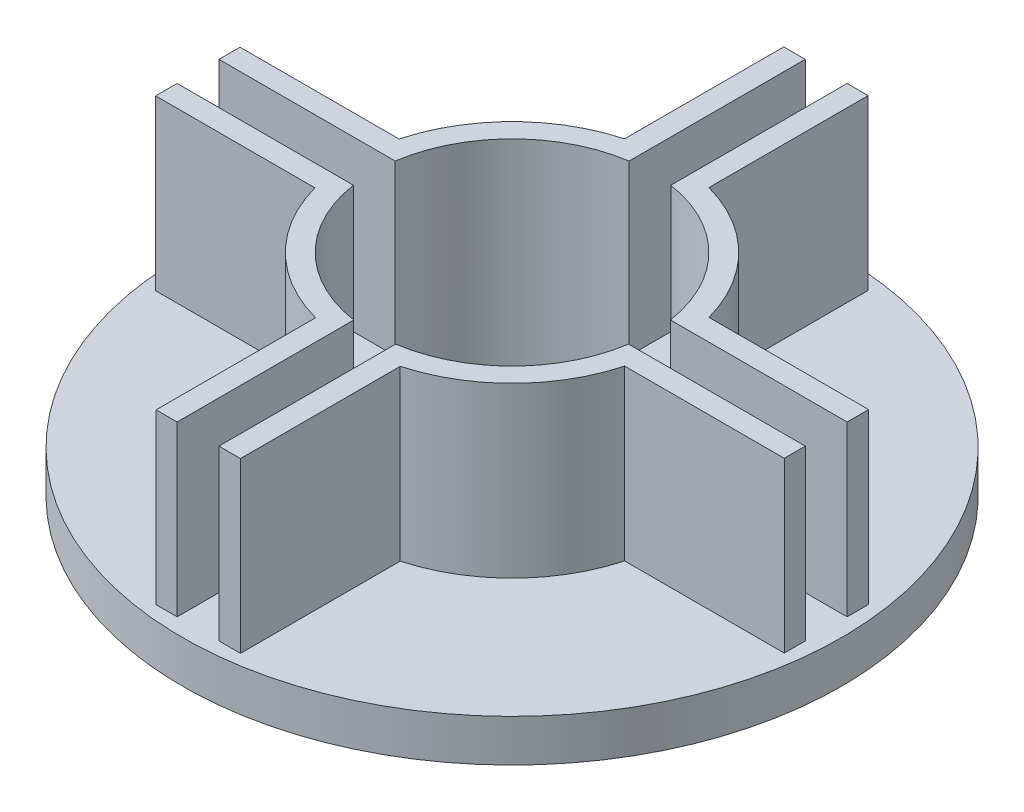
ISO-10303-21;
HEADER;
FILE_DESCRIPTION(('STEP AP214'),'2;1');
FILE_NAME('part.step','',(''),(''),'','','');
FILE_SCHEMA(('AUTOMOTIVE_DESIGN { 1 0 10303 214 1 1 1 1 }'));
ENDSEC;
DATA;
#1=APPLICATION_CONTEXT('core data for automotive mechanical design processes');
#2=APPLICATION_PROTOCOL_DEFINITION('international standard','automotive_design',2000,#1);
#3=PRODUCT_CONTEXT('',#1,'mechanical');
#4=PRODUCT('Part','Part','',(#3));
#5=PRODUCT_RELATED_PRODUCT_CATEGORY('part','',(#4));
#6=PRODUCT_DEFINITION_FORMATION('','',#4);
#7=PRODUCT_DEFINITION_CONTEXT('part definition',#1,'design');
#8=PRODUCT_DEFINITION('design','',#6,#7);
#9=PRODUCT_DEFINITION_SHAPE('','',#8);
#10=(LENGTH_UNIT() NAMED_UNIT(*) SI_UNIT(.MILLI.,.METRE.));
#11=(NAMED_UNIT(*) PLANE_ANGLE_UNIT() SI_UNIT($,.RADIAN.));
#12=(NAMED_UNIT(*) SI_UNIT($,.STERADIAN.) SOLID_ANGLE_UNIT());
#13=UNCERTAINTY_MEASURE_WITH_UNIT(LENGTH_MEASURE(1.E-05),#10,'distance_accuracy_value','');
#14=(GEOMETRIC_REPRESENTATION_CONTEXT(3) GLOBAL_UNCERTAINTY_ASSIGNED_CONTEXT((#13)) GLOBAL_UNIT_ASSIGNED_CONTEXT((#10,
#11,#12)) REPRESENTATION_CONTEXT('',''));
#15=CARTESIAN_POINT('',(0.,0.,0.));
#16=DIRECTION('',(0.,0.,1.));
#17=DIRECTION('',(1.,0.,0.));
#18=AXIS2_PLACEMENT_3D('',#15,#16,#17);
#19=CARTESIAN_POINT('',(0.,25.4,0.));
#20=DIRECTION('',(0.,1.,0.));
#21=DIRECTION('',(0.,0.,1.));
#22=AXIS2_PLACEMENT_3D('',#19,#20,#21);
#23=PLANE('',#22);
#24=DIRECTION('',(0.,0.,-1.));
#25=VECTOR('',#24,1.);
#26=CARTESIAN_POINT('',(3.1844151598015,25.4,-47.2495068220518));
#27=LINE('',#26,#25);
#28=CARTESIAN_POINT('',(3.1844151598015,25.4,-20.711627774997));
#29=VERTEX_POINT('',#28);
#30=CARTESIAN_POINT('',(3.1844151598015,25.4,-47.2495068220518));
#31=VERTEX_POINT('',#30);
#32=EDGE_CURVE('E243',#29,#31,#27,.T.);
#33=ORIENTED_EDGE('',*,*,#32,.F.);
#34=CARTESIAN_POINT('',(0.,25.4,0.));
#35=DIRECTION('',(0.,1.,0.));
#36=DIRECTION('',(0.,0.,1.));
#37=AXIS2_PLACEMENT_3D('',#34,#35,#36);
#38=CIRCLE('',#37,20.955);
#39=CARTESIAN_POINT('',(20.721291310276,25.4,-3.12091515980172));
#40=VERTEX_POINT('',#39);
#41=EDGE_CURVE('E360',#29,#40,#38,.F.);
#42=ORIENTED_EDGE('',*,*,#41,.T.);
#43=DIRECTION('',(1.,0.,0.));
#44=VECTOR('',#43,1.);
#45=CARTESIAN_POINT('',(47.3130068220515,25.4,-3.12091515980172));
#46=LINE('',#45,#44);
#47=CARTESIAN_POINT('',(47.3130068220515,25.4,-3.12091515980172));
#48=VERTEX_POINT('',#47);
#49=EDGE_CURVE('E452',#40,#48,#46,.T.);
#50=ORIENTED_EDGE('',*,*,#49,.T.);
#51=DIRECTION('',(0.,0.,-1.));
#52=VECTOR('',#51,1.);
#53=CARTESIAN_POINT('',(47.3130068220515,25.4,-6.35941515980172));
#54=LINE('',#53,#52);
#55=CARTESIAN_POINT('',(47.3130068220515,25.4,-6.35941515980172));
#56=VERTEX_POINT('',#55);
#57=EDGE_CURVE('E448',#48,#56,#54,.T.);
#58=ORIENTED_EDGE('',*,*,#57,.T.);
#59=DIRECTION('',(-1.,0.,0.));
#60=VECTOR('',#59,1.);
#61=CARTESIAN_POINT('',(22.1913230217083,25.4,-6.35941515980172));
#62=LINE('',#61,#60);
#63=CARTESIAN_POINT('',(23.2769142891682,25.4,-6.35941515980172));
#64=VERTEX_POINT('',#63);
#65=EDGE_CURVE('E441',#56,#64,#62,.T.);
#66=ORIENTED_EDGE('',*,*,#65,.T.);
#67=CARTESIAN_POINT('',(0.,25.4,0.));
#68=DIRECTION('',(0.,1.,0.));
#69=DIRECTION('',(0.,0.,1.));
#70=AXIS2_PLACEMENT_3D('',#67,#68,#69);
#71=CIRCLE('',#70,24.13);
#72=CARTESIAN_POINT('',(6.35,25.4,-23.2794845303757));
#73=VERTEX_POINT('',#72);
#74=EDGE_CURVE('E296',#64,#73,#71,.T.);
#75=ORIENTED_EDGE('',*,*,#74,.T.);
#76=DIRECTION('',(0.,0.,-1.));
#77=VECTOR('',#76,1.);
#78=CARTESIAN_POINT('',(6.35,25.4,-22.1278230217086));
#79=LINE('',#78,#77);
#80=CARTESIAN_POINT('',(6.35,25.4,-47.2495068220518));
#81=VERTEX_POINT('',#80);
#82=EDGE_CURVE('E267',#73,#81,#79,.T.);
#83=ORIENTED_EDGE('',*,*,#82,.T.);
#84=DIRECTION('',(-1.,0.,0.));
#85=VECTOR('',#84,1.);
#86=CARTESIAN_POINT('',(6.35,25.4,-47.2495068220518));
#87=LINE('',#86,#85);
#88=EDGE_CURVE('E261',#81,#31,#87,.T.);
#89=ORIENTED_EDGE('',*,*,#88,.T.);
#90=EDGE_LOOP('',(#33,#42,#50,#58,#66,#75,#83,#89));
#91=FACE_BOUND('',#90,.T.);
#92=ADVANCED_FACE('F37',(#91),#23,.T.);
#93=CARTESIAN_POINT('',(20.7130731664811,25.4,3.17499999999979));
#94=VERTEX_POINT('',#93);
#95=CARTESIAN_POINT('',(3.1844151598015,25.4,20.711627774997));
#96=VERTEX_POINT('',#95);
#97=EDGE_CURVE('E357',#94,#96,#38,.F.);
#98=ORIENTED_EDGE('',*,*,#97,.T.);
#99=DIRECTION('',(0.,0.,1.));
#100=VECTOR('',#99,1.);
#101=CARTESIAN_POINT('',(3.1844151598015,25.4,47.3035916622498));
#102=LINE('',#101,#100);
#103=CARTESIAN_POINT('',(3.1844151598015,25.4,47.3035916622498));
#104=VERTEX_POINT('',#103);
#105=EDGE_CURVE('E413',#96,#104,#102,.T.);
#106=ORIENTED_EDGE('',*,*,#105,.T.);
#107=DIRECTION('',(1.,0.,0.));
#108=VECTOR('',#107,1.);
#109=CARTESIAN_POINT('',(6.4229151598015,25.4,47.3035916622498));
#110=LINE('',#109,#108);
#111=CARTESIAN_POINT('',(6.4229151598015,25.4,47.3035916622498));
#112=VERTEX_POINT('',#111);
#113=EDGE_CURVE('E409',#104,#112,#110,.T.);
#114=ORIENTED_EDGE('',*,*,#113,.T.);
#115=DIRECTION('',(0.,0.,-1.));
#116=VECTOR('',#115,1.);
#117=CARTESIAN_POINT('',(6.4229151598015,25.4,22.1819078619066));
#118=LINE('',#117,#116);
#119=CARTESIAN_POINT('',(6.4229151598015,25.4,23.2594724972428));
#120=VERTEX_POINT('',#119);
#121=EDGE_CURVE('E402',#112,#120,#118,.T.);
#122=ORIENTED_EDGE('',*,*,#121,.T.);
#123=CARTESIAN_POINT('',(0.,25.4,0.));
#124=DIRECTION('',(0.,1.,0.));
#125=DIRECTION('',(0.,0.,1.));
#126=AXIS2_PLACEMENT_3D('',#123,#124,#125);
#127=CIRCLE('',#126,24.13);
#128=CARTESIAN_POINT('',(23.28205068039,25.4,6.34058484019828));
#129=VERTEX_POINT('',#128);
#130=EDGE_CURVE('E294',#120,#129,#127,.T.);
#131=ORIENTED_EDGE('',*,*,#130,.T.);
#132=DIRECTION('',(1.,0.,0.));
#133=VECTOR('',#132,1.);
#134=CARTESIAN_POINT('',(22.1913230217083,25.4,6.34058484019828));
#135=LINE('',#134,#133);
#136=CARTESIAN_POINT('',(47.3130068220515,25.4,6.34058484019828));
#137=VERTEX_POINT('',#136);
#138=EDGE_CURVE('E464',#129,#137,#135,.T.);
#139=ORIENTED_EDGE('',*,*,#138,.T.);
#140=DIRECTION('',(0.,0.,-1.));
#141=VECTOR('',#140,1.);
#142=CARTESIAN_POINT('',(47.3130068220515,25.4,6.34058484019828));
#143=LINE('',#142,#141);
#144=CARTESIAN_POINT('',(47.3130068220515,25.4,3.17499999999979));
#145=VERTEX_POINT('',#144);
#146=EDGE_CURVE('E468',#137,#145,#143,.T.);
#147=ORIENTED_EDGE('',*,*,#146,.T.);
#148=DIRECTION('',(1.,0.,0.));
#149=VECTOR('',#148,1.);
#150=CARTESIAN_POINT('',(47.3130068220515,25.4,3.17499999999979));
#151=LINE('',#150,#149);
#152=EDGE_CURVE('E338',#94,#145,#151,.T.);
#153=ORIENTED_EDGE('',*,*,#152,.F.);
#154=EDGE_LOOP('',(#98,#106,#114,#122,#131,#139,#147,#153));
#155=FACE_BOUND('',#154,.T.);
#156=ADVANCED_FACE('F602',(#155),#23,.T.);
#157=CARTESIAN_POINT('',(-20.721291310276,25.4,-3.12091515980172));
#158=VERTEX_POINT('',#157);
#159=CARTESIAN_POINT('',(-3.1115,25.4,-20.7227071771523));
#160=VERTEX_POINT('',#159);
#161=EDGE_CURVE('E361',#158,#160,#38,.F.);
#162=ORIENTED_EDGE('',*,*,#161,.T.);
#163=DIRECTION('',(0.,0.,1.));
#164=VECTOR('',#163,1.);
#165=CARTESIAN_POINT('',(-3.1115,25.4,0.));
#166=LINE('',#165,#164);
#167=CARTESIAN_POINT('',(-3.1115,25.4,-47.2495068220518));
#168=VERTEX_POINT('',#167);
#169=EDGE_CURVE('E289',#168,#160,#166,.T.);
#170=ORIENTED_EDGE('',*,*,#169,.F.);
#171=DIRECTION('',(-1.,0.,0.));
#172=VECTOR('',#171,1.);
#173=CARTESIAN_POINT('',(-6.35,25.4,-47.2495068220518));
#174=LINE('',#173,#172);
#175=CARTESIAN_POINT('',(-6.35,25.4,-47.2495068220518));
#176=VERTEX_POINT('',#175);
#177=EDGE_CURVE('E486',#168,#176,#174,.T.);
#178=ORIENTED_EDGE('',*,*,#177,.T.);
#179=DIRECTION('',(0.,0.,1.));
#180=VECTOR('',#179,1.);
#181=CARTESIAN_POINT('',(-6.35,25.4,-22.1278230217086));
#182=LINE('',#181,#180);
#183=CARTESIAN_POINT('',(-6.35,25.4,-23.2794845303757));
#184=VERTEX_POINT('',#183);
#185=EDGE_CURVE('E481',#176,#184,#182,.T.);
#186=ORIENTED_EDGE('',*,*,#185,.T.);
#187=CARTESIAN_POINT('',(0.,25.4,0.));
#188=DIRECTION('',(0.,1.,0.));
#189=DIRECTION('',(0.,0.,1.));
#190=AXIS2_PLACEMENT_3D('',#187,#188,#189);
#191=CIRCLE('',#190,24.13);
#192=CARTESIAN_POINT('',(-23.2967125953427,25.4,-6.28650000000021));
#193=VERTEX_POINT('',#192);
#194=EDGE_CURVE('E291',#184,#193,#191,.T.);
#195=ORIENTED_EDGE('',*,*,#194,.T.);
#196=DIRECTION('',(-1.,0.,0.));
#197=VECTOR('',#196,1.);
#198=CARTESIAN_POINT('',(-22.1184078619068,25.4,-6.28650000000021));
#199=LINE('',#198,#197);
#200=CARTESIAN_POINT('',(-47.24009166225,25.4,-6.28650000000021));
#201=VERTEX_POINT('',#200);
#202=EDGE_CURVE('E386',#193,#201,#199,.T.);
#203=ORIENTED_EDGE('',*,*,#202,.T.);
#204=DIRECTION('',(0.,0.,1.));
#205=VECTOR('',#204,1.);
#206=CARTESIAN_POINT('',(-47.24009166225,25.4,-6.28650000000021));
#207=LINE('',#206,#205);
#208=CARTESIAN_POINT('',(-47.24009166225,25.4,-3.12091515980172));
#209=VERTEX_POINT('',#208);
#210=EDGE_CURVE('E390',#201,#209,#207,.T.);
#211=ORIENTED_EDGE('',*,*,#210,.T.);
#212=DIRECTION('',(-1.,0.,0.));
#213=VECTOR('',#212,1.);
#214=CARTESIAN_POINT('',(47.3130068220515,25.4,-3.12091515980172));
#215=LINE('',#214,#213);
#216=EDGE_CURVE('E342',#158,#209,#215,.T.);
#217=ORIENTED_EDGE('',*,*,#216,.F.);
#218=EDGE_LOOP('',(#162,#170,#178,#186,#195,#203,#211,#217));
#219=FACE_BOUND('',#218,.T.);
#220=ADVANCED_FACE('F555',(#219),#23,.T.);
#221=CARTESIAN_POINT('',(0.,25.4,0.));
#222=DIRECTION('',(0.,-1.,0.));
#223=DIRECTION('',(0.,0.,-1.));
#224=AXIS2_PLACEMENT_3D('',#221,#222,#223);
#225=CYLINDRICAL_SURFACE('',#224,24.13);
#226=DIRECTION('',(0.,-1.,0.));
#227=VECTOR('',#226,1.);
#228=CARTESIAN_POINT('',(-23.262070366801,25.4,6.41349999999978));
#229=LINE('',#228,#227);
#230=CARTESIAN_POINT('',(-23.262070366801,0.,6.41349999999978));
#231=VERTEX_POINT('',#230);
#232=CARTESIAN_POINT('',(-23.262070366801,25.4,6.41349999999979));
#233=VERTEX_POINT('',#232);
#234=EDGE_CURVE('E374',#231,#233,#229,.F.);
#235=ORIENTED_EDGE('',*,*,#234,.F.);
#236=CARTESIAN_POINT('',(0.,0.,0.));
#237=DIRECTION('',(0.,-1.,0.));
#238=DIRECTION('',(0.,0.,-1.));
#239=AXIS2_PLACEMENT_3D('',#236,#237,#238);
#240=CIRCLE('',#239,24.13);
#241=CARTESIAN_POINT('',(-6.2770848401985,0.,23.2992511877303));
#242=VERTEX_POINT('',#241);
#243=EDGE_CURVE('E542',#242,#231,#240,.T.);
#244=ORIENTED_EDGE('',*,*,#243,.F.);
#245=DIRECTION('',(0.,-1.,0.));
#246=VECTOR('',#245,1.);
#247=CARTESIAN_POINT('',(-6.2770848401985,25.4,23.2992511877303));
#248=LINE('',#247,#246);
#249=CARTESIAN_POINT('',(-6.2770848401985,25.4,23.2992511877303));
#250=VERTEX_POINT('',#249);
#251=EDGE_CURVE('E432',#250,#242,#248,.T.);
#252=ORIENTED_EDGE('',*,*,#251,.F.);
#253=CARTESIAN_POINT('',(0.,25.4,0.));
#254=DIRECTION('',(0.,1.,0.));
#255=DIRECTION('',(0.,0.,1.));
#256=AXIS2_PLACEMENT_3D('',#253,#254,#255);
#257=CIRCLE('',#256,24.13);
#258=EDGE_CURVE('E298',#233,#250,#257,.T.);
#259=ORIENTED_EDGE('',*,*,#258,.F.);
#260=EDGE_LOOP('',(#235,#244,#252,#259));
#261=FACE_BOUND('',#260,.T.);
#262=ADVANCED_FACE('F581',(#261),#225,.T.);
#263=DIRECTION('',(0.,-1.,0.));
#264=VECTOR('',#263,1.);
#265=CARTESIAN_POINT('',(-23.2967125953427,25.4,-6.28650000000021));
#266=LINE('',#265,#264);
#267=CARTESIAN_POINT('',(-23.2967125953427,0.,-6.28650000000022));
#268=VERTEX_POINT('',#267);
#269=EDGE_CURVE('E393',#193,#268,#266,.T.);
#270=ORIENTED_EDGE('',*,*,#269,.F.);
#271=ORIENTED_EDGE('',*,*,#194,.F.);
#272=DIRECTION('',(0.,-1.,0.));
#273=VECTOR('',#272,1.);
#274=CARTESIAN_POINT('',(-6.35,25.4,-23.2794845303757));
#275=LINE('',#274,#273);
#276=CARTESIAN_POINT('',(-6.35,0.,-23.2794845303757));
#277=VERTEX_POINT('',#276);
#278=EDGE_CURVE('E489',#277,#184,#275,.F.);
#279=ORIENTED_EDGE('',*,*,#278,.F.);
#280=EDGE_CURVE('E271',#268,#277,#240,.T.);
#281=ORIENTED_EDGE('',*,*,#280,.F.);
#282=EDGE_LOOP('',(#270,#271,#279,#281));
#283=FACE_BOUND('',#282,.T.);
#284=ADVANCED_FACE('F551',(#283),#225,.T.);
#285=DIRECTION('',(0.,-1.,0.));
#286=VECTOR('',#285,1.);
#287=CARTESIAN_POINT('',(6.4229151598015,25.4,23.2594724972428));
#288=LINE('',#287,#286);
#289=CARTESIAN_POINT('',(6.4229151598015,0.,23.2594724972428));
#290=VERTEX_POINT('',#289);
#291=EDGE_CURVE('E412',#290,#120,#288,.F.);
#292=ORIENTED_EDGE('',*,*,#291,.F.);
#293=CARTESIAN_POINT('',(23.28205068039,0.,6.34058484019829));
#294=VERTEX_POINT('',#293);
#295=EDGE_CURVE('E284',#294,#290,#240,.T.);
#296=ORIENTED_EDGE('',*,*,#295,.F.);
#297=DIRECTION('',(0.,-1.,0.));
#298=VECTOR('',#297,1.);
#299=CARTESIAN_POINT('',(23.28205068039,25.4,6.34058484019828));
#300=LINE('',#299,#298);
#301=EDGE_CURVE('E471',#129,#294,#300,.T.);
#302=ORIENTED_EDGE('',*,*,#301,.F.);
#303=ORIENTED_EDGE('',*,*,#130,.F.);
#304=EDGE_LOOP('',(#292,#296,#302,#303));
#305=FACE_BOUND('',#304,.T.);
#306=ADVANCED_FACE('F540',(#305),#225,.T.);
#307=CARTESIAN_POINT('',(-3.1115,0.,25.4));
#308=DIRECTION('',(-1.,0.,0.));
#309=DIRECTION('',(0.,-1.,0.));
#310=AXIS2_PLACEMENT_3D('',#307,#308,#309);
#311=PLANE('',#310);
#312=DIRECTION('',(0.,0.,1.));
#313=VECTOR('',#312,1.);
#314=CARTESIAN_POINT('',(-3.1115,25.4,0.));
#315=LINE('',#314,#313);
#316=CARTESIAN_POINT('',(-3.1115,25.4,20.7227071771523));
#317=VERTEX_POINT('',#316);
#318=CARTESIAN_POINT('',(-3.1115,25.4,47.3035916622498));
#319=VERTEX_POINT('',#318);
#320=EDGE_CURVE('E299',#317,#319,#315,.T.);
#321=ORIENTED_EDGE('',*,*,#320,.T.);
#322=DIRECTION('',(0.,1.,0.));
#323=VECTOR('',#322,1.);
#324=CARTESIAN_POINT('',(-3.1115,-94.762476649154,47.3035916622498));
#325=LINE('',#324,#323);
#326=CARTESIAN_POINT('',(-3.1115,0.,47.3035916622498));
#327=VERTEX_POINT('',#326);
#328=EDGE_CURVE('E264',#327,#319,#325,.T.);
#329=ORIENTED_EDGE('',*,*,#328,.F.);
#330=DIRECTION('',(0.,0.,-1.));
#331=VECTOR('',#330,1.);
#332=CARTESIAN_POINT('',(-3.1115,0.,25.4));
#333=LINE('',#332,#331);
#334=CARTESIAN_POINT('',(-3.1115,0.,20.7227071771523));
#335=VERTEX_POINT('',#334);
#336=EDGE_CURVE('E52',#327,#335,#333,.T.);
#337=ORIENTED_EDGE('',*,*,#336,.T.);
#338=DIRECTION('',(0.,-1.,0.));
#339=VECTOR('',#338,1.);
#340=CARTESIAN_POINT('',(-3.1115,86.0167288172168,20.7227071771523));
#341=LINE('',#340,#339);
#342=EDGE_CURVE('E1000',#317,#335,#341,.T.);
#343=ORIENTED_EDGE('',*,*,#342,.F.);
#344=EDGE_LOOP('',(#321,#329,#337,#343));
#345=FACE_BOUND('',#344,.T.);
#346=ADVANCED_FACE('F616',(#345),#311,.F.);
#347=DIRECTION('',(0.,-1.,0.));
#348=VECTOR('',#347,1.);
#349=CARTESIAN_POINT('',(23.2769142891682,25.4,-6.35941515980172));
#350=LINE('',#349,#348);
#351=CARTESIAN_POINT('',(23.2769142891682,0.,-6.35941515980171));
#352=VERTEX_POINT('',#351);
#353=EDGE_CURVE('E451',#352,#64,#350,.F.);
#354=ORIENTED_EDGE('',*,*,#353,.F.);
#355=CARTESIAN_POINT('',(6.35,0.,-23.2794845303757));
#356=VERTEX_POINT('',#355);
#357=EDGE_CURVE('E280',#356,#352,#240,.T.);
#358=ORIENTED_EDGE('',*,*,#357,.F.);
#359=DIRECTION('',(0.,-1.,0.));
#360=VECTOR('',#359,1.);
#361=CARTESIAN_POINT('',(6.35,25.4,-23.2794845303757));
#362=LINE('',#361,#360);
#363=EDGE_CURVE('E268',#73,#356,#362,.T.);
#364=ORIENTED_EDGE('',*,*,#363,.F.);
#365=ORIENTED_EDGE('',*,*,#74,.F.);
#366=EDGE_LOOP('',(#354,#358,#364,#365));
#367=FACE_BOUND('',#366,.T.);
#368=ADVANCED_FACE('F507',(#367),#225,.T.);
#369=ORIENTED_EDGE('',*,*,#320,.F.);
#370=CARTESIAN_POINT('',(-20.7130731664811,25.4,3.17499999999979));
#371=VERTEX_POINT('',#370);
#372=EDGE_CURVE('E356',#317,#371,#38,.F.);
#373=ORIENTED_EDGE('',*,*,#372,.T.);
#374=DIRECTION('',(-1.,0.,0.));
#375=VECTOR('',#374,1.);
#376=CARTESIAN_POINT('',(-47.24009166225,25.4,3.17499999999979));
#377=LINE('',#376,#375);
#378=CARTESIAN_POINT('',(-47.24009166225,25.4,3.17499999999979));
#379=VERTEX_POINT('',#378);
#380=EDGE_CURVE('E375',#371,#379,#377,.T.);
#381=ORIENTED_EDGE('',*,*,#380,.T.);
#382=DIRECTION('',(0.,0.,1.));
#383=VECTOR('',#382,1.);
#384=CARTESIAN_POINT('',(-47.24009166225,25.4,6.41349999999979));
#385=LINE('',#384,#383);
#386=CARTESIAN_POINT('',(-47.24009166225,25.4,6.41349999999979));
#387=VERTEX_POINT('',#386);
#388=EDGE_CURVE('E371',#379,#387,#385,.T.);
#389=ORIENTED_EDGE('',*,*,#388,.T.);
#390=DIRECTION('',(1.,0.,0.));
#391=VECTOR('',#390,1.);
#392=CARTESIAN_POINT('',(-22.1184078619068,25.4,6.41349999999979));
#393=LINE('',#392,#391);
#394=EDGE_CURVE('E364',#387,#233,#393,.T.);
#395=ORIENTED_EDGE('',*,*,#394,.T.);
#396=ORIENTED_EDGE('',*,*,#258,.T.);
#397=DIRECTION('',(0.,0.,1.));
#398=VECTOR('',#397,1.);
#399=CARTESIAN_POINT('',(-6.2770848401985,25.4,22.1819078619066));
#400=LINE('',#399,#398);
#401=CARTESIAN_POINT('',(-6.2770848401985,25.4,47.3035916622498));
#402=VERTEX_POINT('',#401);
#403=EDGE_CURVE('E425',#250,#402,#400,.T.);
#404=ORIENTED_EDGE('',*,*,#403,.T.);
#405=DIRECTION('',(1.,0.,0.));
#406=VECTOR('',#405,1.);
#407=CARTESIAN_POINT('',(-6.2770848401985,25.4,47.3035916622498));
#408=LINE('',#407,#406);
#409=EDGE_CURVE('E429',#402,#319,#408,.T.);
#410=ORIENTED_EDGE('',*,*,#409,.T.);
#411=EDGE_LOOP('',(#369,#373,#381,#389,#395,#396,#404,#410));
#412=FACE_BOUND('',#411,.T.);
#413=ADVANCED_FACE('F39',(#412),#23,.T.);
#414=CARTESIAN_POINT('',(-3.11150000000001,31.9145661008804,-25.4));
#415=DIRECTION('',(-1.,0.,0.));
#416=DIRECTION('',(0.,-1.,0.));
#417=AXIS2_PLACEMENT_3D('',#414,#415,#416);
#418=PLANE('',#417);
#419=ORIENTED_EDGE('',*,*,#169,.T.);
#420=DIRECTION('',(0.,-1.,0.));
#421=VECTOR('',#420,1.);
#422=CARTESIAN_POINT('',(-3.1115,86.0167288172168,-20.7227071771523));
#423=LINE('',#422,#421);
#424=CARTESIAN_POINT('',(-3.1115,0.,-20.7227071771523));
#425=VERTEX_POINT('',#424);
#426=EDGE_CURVE('E565',#425,#160,#423,.F.);
#427=ORIENTED_EDGE('',*,*,#426,.F.);
#428=DIRECTION('',(0.,0.,1.));
#429=VECTOR('',#428,1.);
#430=CARTESIAN_POINT('',(-3.1115,0.,-25.4));
#431=LINE('',#430,#429);
#432=CARTESIAN_POINT('',(-3.1115,0.,-47.2495068220518));
#433=VERTEX_POINT('',#432);
#434=EDGE_CURVE('E287',#433,#425,#431,.T.);
#435=ORIENTED_EDGE('',*,*,#434,.F.);
#436=DIRECTION('',(0.,-1.,0.));
#437=VECTOR('',#436,1.);
#438=CARTESIAN_POINT('',(-3.1115,51.645898413232,-47.2495068220518));
#439=LINE('',#438,#437);
#440=EDGE_CURVE('E477',#168,#433,#439,.T.);
#441=ORIENTED_EDGE('',*,*,#440,.F.);
#442=EDGE_LOOP('',(#419,#427,#435,#441));
#443=FACE_BOUND('',#442,.T.);
#444=ADVANCED_FACE('F608',(#443),#418,.F.);
#445=CARTESIAN_POINT('',(0.,0.,0.));
#446=DIRECTION('',(0.,-1.,0.));
#447=DIRECTION('',(0.,0.,-1.));
#448=AXIS2_PLACEMENT_3D('',#445,#446,#447);
#449=CYLINDRICAL_SURFACE('',#448,49.609375);
#450=CARTESIAN_POINT('',(0.,0.,0.));
#451=DIRECTION('',(0.,-1.,0.));
#452=DIRECTION('',(0.,0.,-1.));
#453=AXIS2_PLACEMENT_3D('',#450,#451,#452);
#454=CIRCLE('',#453,49.609375);
#455=CARTESIAN_POINT('',(0.,0.,-49.609375));
#456=VERTEX_POINT('',#455);
#457=EDGE_CURVE('E283',#456,#456,#454,.T.);
#458=ORIENTED_EDGE('',*,*,#457,.T.);
#459=EDGE_LOOP('',(#458));
#460=FACE_BOUND('',#459,.T.);
#461=CARTESIAN_POINT('',(0.,-6.35,0.));
#462=DIRECTION('',(0.,-1.,0.));
#463=DIRECTION('',(0.,0.,-1.));
#464=AXIS2_PLACEMENT_3D('',#461,#462,#463);
#465=CIRCLE('',#464,49.609375);
#466=CARTESIAN_POINT('',(0.,-6.35,-49.609375));
#467=VERTEX_POINT('',#466);
#468=EDGE_CURVE('E353',#467,#467,#465,.T.);
#469=ORIENTED_EDGE('',*,*,#468,.F.);
#470=EDGE_LOOP('',(#469));
#471=FACE_BOUND('',#470,.T.);
#472=ADVANCED_FACE('F613',(#460,#471),#449,.T.);
#473=CARTESIAN_POINT('',(6.35,51.645898413232,-22.1278230217086));
#474=DIRECTION('',(-1.,0.,0.));
#475=DIRECTION('',(0.,0.,1.));
#476=AXIS2_PLACEMENT_3D('',#473,#474,#475);
#477=PLANE('',#476);
#478=ORIENTED_EDGE('',*,*,#82,.F.);
#479=ORIENTED_EDGE('',*,*,#363,.T.);
#480=DIRECTION('',(0.,0.,-1.));
#481=VECTOR('',#480,1.);
#482=CARTESIAN_POINT('',(6.35,0.,-22.1278230217086));
#483=LINE('',#482,#481);
#484=CARTESIAN_POINT('',(6.35,0.,-47.2495068220518));
#485=VERTEX_POINT('',#484);
#486=EDGE_CURVE('E275',#356,#485,#483,.T.);
#487=ORIENTED_EDGE('',*,*,#486,.T.);
#488=DIRECTION('',(0.,-1.,0.));
#489=VECTOR('',#488,1.);
#490=CARTESIAN_POINT('',(6.35,51.645898413232,-47.2495068220518));
#491=LINE('',#490,#489);
#492=EDGE_CURVE('E278',#81,#485,#491,.T.);
#493=ORIENTED_EDGE('',*,*,#492,.F.);
#494=EDGE_LOOP('',(#478,#479,#487,#493));
#495=FACE_BOUND('',#494,.T.);
#496=ADVANCED_FACE('F501',(#495),#477,.F.);
#497=CARTESIAN_POINT('',(6.35,51.645898413232,-47.2495068220518));
#498=DIRECTION('',(0.,0.,1.));
#499=DIRECTION('',(1.,0.,0.));
#500=AXIS2_PLACEMENT_3D('',#497,#498,#499);
#501=PLANE('',#500);
#502=DIRECTION('',(-1.,0.,0.));
#503=VECTOR('',#502,1.);
#504=CARTESIAN_POINT('',(6.35,0.,-47.2495068220518));
#505=LINE('',#504,#503);
#506=CARTESIAN_POINT('',(3.1844151598015,0.,-47.2495068220518));
#507=VERTEX_POINT('',#506);
#508=EDGE_CURVE('E263',#485,#507,#505,.T.);
#509=ORIENTED_EDGE('',*,*,#508,.T.);
#510=DIRECTION('',(0.,1.,0.));
#511=VECTOR('',#510,1.);
#512=CARTESIAN_POINT('',(3.1844151598015,-94.762476649154,-47.2495068220518));
#513=LINE('',#512,#511);
#514=EDGE_CURVE('E247',#507,#31,#513,.T.);
#515=ORIENTED_EDGE('',*,*,#514,.T.);
#516=ORIENTED_EDGE('',*,*,#88,.F.);
#517=ORIENTED_EDGE('',*,*,#492,.T.);
#518=EDGE_LOOP('',(#509,#515,#516,#517));
#519=FACE_BOUND('',#518,.T.);
#520=ADVANCED_FACE('F259',(#519),#501,.F.);
#521=CARTESIAN_POINT('',(-6.35,51.645898413232,-22.1278230217086));
#522=DIRECTION('',(1.,0.,0.));
#523=DIRECTION('',(0.,0.,-1.));
#524=AXIS2_PLACEMENT_3D('',#521,#522,#523);
#525=PLANE('',#524);
#526=DIRECTION('',(0.,0.,1.));
#527=VECTOR('',#526,1.);
#528=CARTESIAN_POINT('',(-6.35,0.,-22.1278230217086));
#529=LINE('',#528,#527);
#530=CARTESIAN_POINT('',(-6.35,0.,-47.2495068220518));
#531=VERTEX_POINT('',#530);
#532=EDGE_CURVE('E478',#531,#277,#529,.T.);
#533=ORIENTED_EDGE('',*,*,#532,.T.);
#534=ORIENTED_EDGE('',*,*,#278,.T.);
#535=ORIENTED_EDGE('',*,*,#185,.F.);
#536=DIRECTION('',(0.,-1.,0.));
#537=VECTOR('',#536,1.);
#538=CARTESIAN_POINT('',(-6.35,51.645898413232,-47.2495068220518));
#539=LINE('',#538,#537);
#540=EDGE_CURVE('E482',#176,#531,#539,.T.);
#541=ORIENTED_EDGE('',*,*,#540,.T.);
#542=EDGE_LOOP('',(#533,#534,#535,#541));
#543=FACE_BOUND('',#542,.T.);
#544=ADVANCED_FACE('F550',(#543),#525,.F.);
#545=CARTESIAN_POINT('',(-6.35,51.645898413232,-47.2495068220518));
#546=DIRECTION('',(0.,0.,1.));
#547=DIRECTION('',(1.,0.,0.));
#548=AXIS2_PLACEMENT_3D('',#545,#546,#547);
#549=PLANE('',#548);
#550=ORIENTED_EDGE('',*,*,#177,.F.);
#551=ORIENTED_EDGE('',*,*,#440,.T.);
#552=DIRECTION('',(-1.,0.,0.));
#553=VECTOR('',#552,1.);
#554=CARTESIAN_POINT('',(-6.35,0.,-47.2495068220518));
#555=LINE('',#554,#553);
#556=EDGE_CURVE('E483',#433,#531,#555,.T.);
#557=ORIENTED_EDGE('',*,*,#556,.T.);
#558=ORIENTED_EDGE('',*,*,#540,.F.);
#559=EDGE_LOOP('',(#550,#551,#557,#558));
#560=FACE_BOUND('',#559,.T.);
#561=ADVANCED_FACE('F636',(#560),#549,.F.);
#562=CARTESIAN_POINT('',(22.1913230217083,51.645898413232,6.34058484019828));
#563=DIRECTION('',(0.,0.,-1.));
#564=DIRECTION('',(-1.,0.,0.));
#565=AXIS2_PLACEMENT_3D('',#562,#563,#564);
#566=PLANE('',#565);
#567=ORIENTED_EDGE('',*,*,#138,.F.);
#568=ORIENTED_EDGE('',*,*,#301,.T.);
#569=DIRECTION('',(1.,0.,0.));
#570=VECTOR('',#569,1.);
#571=CARTESIAN_POINT('',(22.1913230217083,0.,6.34058484019828));
#572=LINE('',#571,#570);
#573=CARTESIAN_POINT('',(47.3130068220515,0.,6.34058484019828));
#574=VERTEX_POINT('',#573);
#575=EDGE_CURVE('E460',#294,#574,#572,.T.);
#576=ORIENTED_EDGE('',*,*,#575,.T.);
#577=DIRECTION('',(0.,-1.,0.));
#578=VECTOR('',#577,1.);
#579=CARTESIAN_POINT('',(47.3130068220515,51.645898413232,6.34058484019828));
#580=LINE('',#579,#578);
#581=EDGE_CURVE('E465',#137,#574,#580,.T.);
#582=ORIENTED_EDGE('',*,*,#581,.F.);
#583=EDGE_LOOP('',(#567,#568,#576,#582));
#584=FACE_BOUND('',#583,.T.);
#585=ADVANCED_FACE('F533',(#584),#566,.F.);
#586=CARTESIAN_POINT('',(47.3130068220515,51.645898413232,6.34058484019828));
#587=DIRECTION('',(-1.,0.,0.));
#588=DIRECTION('',(0.,0.,1.));
#589=AXIS2_PLACEMENT_3D('',#586,#587,#588);
#590=PLANE('',#589);
#591=DIRECTION('',(0.,0.,-1.));
#592=VECTOR('',#591,1.);
#593=CARTESIAN_POINT('',(47.3130068220515,0.,6.34058484019828));
#594=LINE('',#593,#592);
#595=CARTESIAN_POINT('',(47.3130068220515,0.,3.17499999999979));
#596=VERTEX_POINT('',#595);
#597=EDGE_CURVE('E461',#574,#596,#594,.T.);
#598=ORIENTED_EDGE('',*,*,#597,.T.);
#599=DIRECTION('',(0.,1.,0.));
#600=VECTOR('',#599,1.);
#601=CARTESIAN_POINT('',(47.3130068220515,-94.762476649154,3.17499999999979));
#602=LINE('',#601,#600);
#603=EDGE_CURVE('E347',#596,#145,#602,.T.);
#604=ORIENTED_EDGE('',*,*,#603,.T.);
#605=ORIENTED_EDGE('',*,*,#146,.F.);
#606=ORIENTED_EDGE('',*,*,#581,.T.);
#607=EDGE_LOOP('',(#598,#604,#605,#606));
#608=FACE_BOUND('',#607,.T.);
#609=ADVANCED_FACE('F529',(#608),#590,.F.);
#610=CARTESIAN_POINT('',(47.3130068220515,51.645898413232,-3.12091515980172));
#611=DIRECTION('',(0.,0.,-1.));
#612=DIRECTION('',(-1.,0.,0.));
#613=AXIS2_PLACEMENT_3D('',#610,#611,#612);
#614=PLANE('',#613);
#615=ORIENTED_EDGE('',*,*,#49,.F.);
#616=DIRECTION('',(0.,-1.,0.));
#617=VECTOR('',#616,1.);
#618=CARTESIAN_POINT('',(20.721291310276,86.0167288172168,-3.12091515980172));
#619=LINE('',#618,#617);
#620=CARTESIAN_POINT('',(20.721291310276,0.,-3.12091515980172));
#621=VERTEX_POINT('',#620);
#622=EDGE_CURVE('E309',#621,#40,#619,.F.);
#623=ORIENTED_EDGE('',*,*,#622,.F.);
#624=DIRECTION('',(1.,0.,0.));
#625=VECTOR('',#624,1.);
#626=CARTESIAN_POINT('',(47.3130068220515,0.,-3.12091515980172));
#627=LINE('',#626,#625);
#628=CARTESIAN_POINT('',(47.3130068220515,0.,-3.12091515980172));
#629=VERTEX_POINT('',#628);
#630=EDGE_CURVE('E438',#621,#629,#627,.T.);
#631=ORIENTED_EDGE('',*,*,#630,.T.);
#632=DIRECTION('',(0.,-1.,0.));
#633=VECTOR('',#632,1.);
#634=CARTESIAN_POINT('',(47.3130068220515,51.645898413232,-3.12091515980172));
#635=LINE('',#634,#633);
#636=EDGE_CURVE('E446',#48,#629,#635,.T.);
#637=ORIENTED_EDGE('',*,*,#636,.F.);
#638=EDGE_LOOP('',(#615,#623,#631,#637));
#639=FACE_BOUND('',#638,.T.);
#640=ADVANCED_FACE('F521',(#639),#614,.F.);
#641=CARTESIAN_POINT('',(22.1913230217083,51.645898413232,-6.35941515980172));
#642=DIRECTION('',(0.,0.,1.));
#643=DIRECTION('',(1.,0.,0.));
#644=AXIS2_PLACEMENT_3D('',#641,#642,#643);
#645=PLANE('',#644);
#646=DIRECTION('',(-1.,0.,0.));
#647=VECTOR('',#646,1.);
#648=CARTESIAN_POINT('',(22.1913230217083,0.,-6.35941515980172));
#649=LINE('',#648,#647);
#650=CARTESIAN_POINT('',(47.3130068220515,0.,-6.35941515980172));
#651=VERTEX_POINT('',#650);
#652=EDGE_CURVE('E439',#651,#352,#649,.T.);
#653=ORIENTED_EDGE('',*,*,#652,.T.);
#654=ORIENTED_EDGE('',*,*,#353,.T.);
#655=ORIENTED_EDGE('',*,*,#65,.F.);
#656=DIRECTION('',(0.,-1.,0.));
#657=VECTOR('',#656,1.);
#658=CARTESIAN_POINT('',(47.3130068220515,51.645898413232,-6.35941515980172));
#659=LINE('',#658,#657);
#660=EDGE_CURVE('E442',#56,#651,#659,.T.);
#661=ORIENTED_EDGE('',*,*,#660,.T.);
#662=EDGE_LOOP('',(#653,#654,#655,#661));
#663=FACE_BOUND('',#662,.T.);
#664=ADVANCED_FACE('F511',(#663),#645,.F.);
#665=CARTESIAN_POINT('',(47.3130068220515,51.645898413232,-6.35941515980172));
#666=DIRECTION('',(-1.,0.,0.));
#667=DIRECTION('',(0.,0.,1.));
#668=AXIS2_PLACEMENT_3D('',#665,#666,#667);
#669=PLANE('',#668);
#670=ORIENTED_EDGE('',*,*,#57,.F.);
#671=ORIENTED_EDGE('',*,*,#636,.T.);
#672=DIRECTION('',(0.,0.,-1.));
#673=VECTOR('',#672,1.);
#674=CARTESIAN_POINT('',(47.3130068220515,0.,-6.35941515980172));
#675=LINE('',#674,#673);
#676=EDGE_CURVE('E443',#629,#651,#675,.T.);
#677=ORIENTED_EDGE('',*,*,#676,.T.);
#678=ORIENTED_EDGE('',*,*,#660,.F.);
#679=EDGE_LOOP('',(#670,#671,#677,#678));
#680=FACE_BOUND('',#679,.T.);
#681=ADVANCED_FACE('F517',(#680),#669,.F.);
#682=CARTESIAN_POINT('',(-6.2770848401985,51.645898413232,22.1819078619066));
#683=DIRECTION('',(1.,0.,0.));
#684=DIRECTION('',(0.,0.,-1.));
#685=AXIS2_PLACEMENT_3D('',#682,#683,#684);
#686=PLANE('',#685);
#687=ORIENTED_EDGE('',*,*,#403,.F.);
#688=ORIENTED_EDGE('',*,*,#251,.T.);
#689=DIRECTION('',(0.,0.,1.));
#690=VECTOR('',#689,1.);
#691=CARTESIAN_POINT('',(-6.2770848401985,0.,22.1819078619066));
#692=LINE('',#691,#690);
#693=CARTESIAN_POINT('',(-6.2770848401985,0.,47.3035916622498));
#694=VERTEX_POINT('',#693);
#695=EDGE_CURVE('E421',#242,#694,#692,.T.);
#696=ORIENTED_EDGE('',*,*,#695,.T.);
#697=DIRECTION('',(0.,-1.,0.));
#698=VECTOR('',#697,1.);
#699=CARTESIAN_POINT('',(-6.2770848401985,51.645898413232,47.3035916622498));
#700=LINE('',#699,#698);
#701=EDGE_CURVE('E426',#402,#694,#700,.T.);
#702=ORIENTED_EDGE('',*,*,#701,.F.);
#703=EDGE_LOOP('',(#687,#688,#696,#702));
#704=FACE_BOUND('',#703,.T.);
#705=ADVANCED_FACE('F590',(#704),#686,.F.);
#706=CARTESIAN_POINT('',(-6.2770848401985,51.645898413232,47.3035916622498));
#707=DIRECTION('',(0.,0.,-1.));
#708=DIRECTION('',(-1.,0.,0.));
#709=AXIS2_PLACEMENT_3D('',#706,#707,#708);
#710=PLANE('',#709);
#711=DIRECTION('',(1.,0.,0.));
#712=VECTOR('',#711,1.);
#713=CARTESIAN_POINT('',(-6.2770848401985,0.,47.3035916622498));
#714=LINE('',#713,#712);
#715=EDGE_CURVE('E422',#694,#327,#714,.T.);
#716=ORIENTED_EDGE('',*,*,#715,.T.);
#717=ORIENTED_EDGE('',*,*,#328,.T.);
#718=ORIENTED_EDGE('',*,*,#409,.F.);
#719=ORIENTED_EDGE('',*,*,#701,.T.);
#720=EDGE_LOOP('',(#716,#717,#718,#719));
#721=FACE_BOUND('',#720,.T.);
#722=ADVANCED_FACE('F589',(#721),#710,.F.);
#723=CARTESIAN_POINT('',(3.1844151598015,51.645898413232,47.3035916622498));
#724=DIRECTION('',(1.,0.,0.));
#725=DIRECTION('',(0.,0.,-1.));
#726=AXIS2_PLACEMENT_3D('',#723,#724,#725);
#727=PLANE('',#726);
#728=ORIENTED_EDGE('',*,*,#105,.F.);
#729=DIRECTION('',(0.,-1.,0.));
#730=VECTOR('',#729,1.);
#731=CARTESIAN_POINT('',(3.1844151598015,86.0167288172168,20.711627774997));
#732=LINE('',#731,#730);
#733=CARTESIAN_POINT('',(3.1844151598015,0.,20.711627774997));
#734=VERTEX_POINT('',#733);
#735=EDGE_CURVE('E562',#734,#96,#732,.F.);
#736=ORIENTED_EDGE('',*,*,#735,.F.);
#737=DIRECTION('',(0.,0.,1.));
#738=VECTOR('',#737,1.);
#739=CARTESIAN_POINT('',(3.1844151598015,0.,47.3035916622498));
#740=LINE('',#739,#738);
#741=CARTESIAN_POINT('',(3.1844151598015,0.,47.3035916622498));
#742=VERTEX_POINT('',#741);
#743=EDGE_CURVE('E399',#734,#742,#740,.T.);
#744=ORIENTED_EDGE('',*,*,#743,.T.);
#745=DIRECTION('',(0.,-1.,0.));
#746=VECTOR('',#745,1.);
#747=CARTESIAN_POINT('',(3.1844151598015,51.645898413232,47.3035916622498));
#748=LINE('',#747,#746);
#749=EDGE_CURVE('E407',#104,#742,#748,.T.);
#750=ORIENTED_EDGE('',*,*,#749,.F.);
#751=EDGE_LOOP('',(#728,#736,#744,#750));
#752=FACE_BOUND('',#751,.T.);
#753=ADVANCED_FACE('F597',(#752),#727,.F.);
#754=CARTESIAN_POINT('',(6.4229151598015,51.645898413232,22.1819078619066));
#755=DIRECTION('',(-1.,0.,0.));
#756=DIRECTION('',(0.,0.,1.));
#757=AXIS2_PLACEMENT_3D('',#754,#755,#756);
#758=PLANE('',#757);
#759=DIRECTION('',(0.,0.,-1.));
#760=VECTOR('',#759,1.);
#761=CARTESIAN_POINT('',(6.4229151598015,0.,22.1819078619066));
#762=LINE('',#761,#760);
#763=CARTESIAN_POINT('',(6.4229151598015,0.,47.3035916622498));
#764=VERTEX_POINT('',#763);
#765=EDGE_CURVE('E400',#764,#290,#762,.T.);
#766=ORIENTED_EDGE('',*,*,#765,.T.);
#767=ORIENTED_EDGE('',*,*,#291,.T.);
#768=ORIENTED_EDGE('',*,*,#121,.F.);
#769=DIRECTION('',(0.,-1.,0.));
#770=VECTOR('',#769,1.);
#771=CARTESIAN_POINT('',(6.4229151598015,51.645898413232,47.3035916622498));
#772=LINE('',#771,#770);
#773=EDGE_CURVE('E403',#112,#764,#772,.T.);
#774=ORIENTED_EDGE('',*,*,#773,.T.);
#775=EDGE_LOOP('',(#766,#767,#768,#774));
#776=FACE_BOUND('',#775,.T.);
#777=ADVANCED_FACE('F667',(#776),#758,.F.);
#778=CARTESIAN_POINT('',(6.4229151598015,51.645898413232,47.3035916622498));
#779=DIRECTION('',(0.,0.,-1.));
#780=DIRECTION('',(-1.,0.,0.));
#781=AXIS2_PLACEMENT_3D('',#778,#779,#780);
#782=PLANE('',#781);
#783=ORIENTED_EDGE('',*,*,#113,.F.);
#784=ORIENTED_EDGE('',*,*,#749,.T.);
#785=DIRECTION('',(1.,0.,0.));
#786=VECTOR('',#785,1.);
#787=CARTESIAN_POINT('',(6.4229151598015,0.,47.3035916622498));
#788=LINE('',#787,#786);
#789=EDGE_CURVE('E404',#742,#764,#788,.T.);
#790=ORIENTED_EDGE('',*,*,#789,.T.);
#791=ORIENTED_EDGE('',*,*,#773,.F.);
#792=EDGE_LOOP('',(#783,#784,#790,#791));
#793=FACE_BOUND('',#792,.T.);
#794=ADVANCED_FACE('F672',(#793),#782,.F.);
#795=CARTESIAN_POINT('',(-22.1184078619068,51.645898413232,-6.28650000000021));
#796=DIRECTION('',(0.,0.,1.));
#797=DIRECTION('',(1.,0.,0.));
#798=AXIS2_PLACEMENT_3D('',#795,#796,#797);
#799=PLANE('',#798);
#800=ORIENTED_EDGE('',*,*,#202,.F.);
#801=ORIENTED_EDGE('',*,*,#269,.T.);
#802=DIRECTION('',(-1.,0.,0.));
#803=VECTOR('',#802,1.);
#804=CARTESIAN_POINT('',(-22.1184078619068,0.,-6.28650000000021));
#805=LINE('',#804,#803);
#806=CARTESIAN_POINT('',(-47.24009166225,0.,-6.28650000000021));
#807=VERTEX_POINT('',#806);
#808=EDGE_CURVE('E383',#268,#807,#805,.T.);
#809=ORIENTED_EDGE('',*,*,#808,.T.);
#810=DIRECTION('',(0.,-1.,0.));
#811=VECTOR('',#810,1.);
#812=CARTESIAN_POINT('',(-47.24009166225,51.645898413232,-6.28650000000021));
#813=LINE('',#812,#811);
#814=EDGE_CURVE('E387',#201,#807,#813,.T.);
#815=ORIENTED_EDGE('',*,*,#814,.F.);
#816=EDGE_LOOP('',(#800,#801,#809,#815));
#817=FACE_BOUND('',#816,.T.);
#818=ADVANCED_FACE('F559',(#817),#799,.F.);
#819=CARTESIAN_POINT('',(-47.24009166225,51.645898413232,-6.28650000000021));
#820=DIRECTION('',(1.,0.,0.));
#821=DIRECTION('',(0.,0.,-1.));
#822=AXIS2_PLACEMENT_3D('',#819,#820,#821);
#823=PLANE('',#822);
#824=DIRECTION('',(0.,0.,1.));
#825=VECTOR('',#824,1.);
#826=CARTESIAN_POINT('',(-47.24009166225,0.,-6.28650000000021));
#827=LINE('',#826,#825);
#828=CARTESIAN_POINT('',(-47.24009166225,0.,-3.12091515980172));
#829=VERTEX_POINT('',#828);
#830=EDGE_CURVE('E384',#807,#829,#827,.T.);
#831=ORIENTED_EDGE('',*,*,#830,.T.);
#832=DIRECTION('',(0.,1.,0.));
#833=VECTOR('',#832,1.);
#834=CARTESIAN_POINT('',(-47.24009166225,-94.762476649154,-3.12091515980172));
#835=LINE('',#834,#833);
#836=EDGE_CURVE('E336',#829,#209,#835,.T.);
#837=ORIENTED_EDGE('',*,*,#836,.T.);
#838=ORIENTED_EDGE('',*,*,#210,.F.);
#839=ORIENTED_EDGE('',*,*,#814,.T.);
#840=EDGE_LOOP('',(#831,#837,#838,#839));
#841=FACE_BOUND('',#840,.T.);
#842=ADVANCED_FACE('F561',(#841),#823,.F.);
#843=CARTESIAN_POINT('',(-47.24009166225,51.645898413232,3.17499999999979));
#844=DIRECTION('',(0.,0.,1.));
#845=DIRECTION('',(1.,0.,0.));
#846=AXIS2_PLACEMENT_3D('',#843,#844,#845);
#847=PLANE('',#846);
#848=ORIENTED_EDGE('',*,*,#380,.F.);
#849=DIRECTION('',(0.,-1.,0.));
#850=VECTOR('',#849,1.);
#851=CARTESIAN_POINT('',(-20.7130731664811,86.0167288172168,3.17499999999979));
#852=LINE('',#851,#850);
#853=CARTESIAN_POINT('',(-20.7130731664811,0.,3.17499999999979));
#854=VERTEX_POINT('',#853);
#855=EDGE_CURVE('E313',#854,#371,#852,.F.);
#856=ORIENTED_EDGE('',*,*,#855,.F.);
#857=DIRECTION('',(-1.,0.,0.));
#858=VECTOR('',#857,1.);
#859=CARTESIAN_POINT('',(-47.24009166225,0.,3.17499999999979));
#860=LINE('',#859,#858);
#861=CARTESIAN_POINT('',(-47.24009166225,0.,3.17499999999979));
#862=VERTEX_POINT('',#861);
#863=EDGE_CURVE('E331',#854,#862,#860,.T.);
#864=ORIENTED_EDGE('',*,*,#863,.T.);
#865=DIRECTION('',(0.,-1.,0.));
#866=VECTOR('',#865,1.);
#867=CARTESIAN_POINT('',(-47.24009166225,51.645898413232,3.17499999999979));
#868=LINE('',#867,#866);
#869=EDGE_CURVE('E369',#379,#862,#868,.T.);
#870=ORIENTED_EDGE('',*,*,#869,.F.);
#871=EDGE_LOOP('',(#848,#856,#864,#870));
#872=FACE_BOUND('',#871,.T.);
#873=ADVANCED_FACE('F572',(#872),#847,.F.);
#874=CARTESIAN_POINT('',(-22.1184078619068,51.645898413232,6.41349999999979));
#875=DIRECTION('',(0.,0.,-1.));
#876=DIRECTION('',(-1.,0.,0.));
#877=AXIS2_PLACEMENT_3D('',#874,#875,#876);
#878=PLANE('',#877);
#879=DIRECTION('',(1.,0.,0.));
#880=VECTOR('',#879,1.);
#881=CARTESIAN_POINT('',(-22.1184078619068,0.,6.41349999999979));
#882=LINE('',#881,#880);
#883=CARTESIAN_POINT('',(-47.24009166225,0.,6.41349999999979));
#884=VERTEX_POINT('',#883);
#885=EDGE_CURVE('E362',#884,#231,#882,.T.);
#886=ORIENTED_EDGE('',*,*,#885,.T.);
#887=ORIENTED_EDGE('',*,*,#234,.T.);
#888=ORIENTED_EDGE('',*,*,#394,.F.);
#889=DIRECTION('',(0.,-1.,0.));
#890=VECTOR('',#889,1.);
#891=CARTESIAN_POINT('',(-47.24009166225,51.645898413232,6.41349999999979));
#892=LINE('',#891,#890);
#893=EDGE_CURVE('E365',#387,#884,#892,.T.);
#894=ORIENTED_EDGE('',*,*,#893,.T.);
#895=EDGE_LOOP('',(#886,#887,#888,#894));
#896=FACE_BOUND('',#895,.T.);
#897=ADVANCED_FACE('F577',(#896),#878,.F.);
#898=CARTESIAN_POINT('',(-47.24009166225,51.645898413232,6.41349999999979));
#899=DIRECTION('',(1.,0.,0.));
#900=DIRECTION('',(0.,0.,-1.));
#901=AXIS2_PLACEMENT_3D('',#898,#899,#900);
#902=PLANE('',#901);
#903=ORIENTED_EDGE('',*,*,#388,.F.);
#904=ORIENTED_EDGE('',*,*,#869,.T.);
#905=DIRECTION('',(0.,0.,1.));
#906=VECTOR('',#905,1.);
#907=CARTESIAN_POINT('',(-47.24009166225,0.,6.41349999999979));
#908=LINE('',#907,#906);
#909=EDGE_CURVE('E366',#862,#884,#908,.T.);
#910=ORIENTED_EDGE('',*,*,#909,.T.);
#911=ORIENTED_EDGE('',*,*,#893,.F.);
#912=EDGE_LOOP('',(#903,#904,#910,#911));
#913=FACE_BOUND('',#912,.T.);
#914=ADVANCED_FACE('F574',(#913),#902,.F.);
#915=CARTESIAN_POINT('',(0.,86.0167288172168,0.));
#916=DIRECTION('',(0.,-1.,0.));
#917=DIRECTION('',(0.,0.,-1.));
#918=AXIS2_PLACEMENT_3D('',#915,#916,#917);
#919=CYLINDRICAL_SURFACE('',#918,20.955);
#920=ORIENTED_EDGE('',*,*,#41,.F.);
#921=DIRECTION('',(0.,-1.,0.));
#922=VECTOR('',#921,1.);
#923=CARTESIAN_POINT('',(3.1844151598015,86.0167288172168,-20.711627774997));
#924=LINE('',#923,#922);
#925=CARTESIAN_POINT('',(3.1844151598015,0.,-20.711627774997));
#926=VERTEX_POINT('',#925);
#927=EDGE_CURVE('E250',#29,#926,#924,.T.);
#928=ORIENTED_EDGE('',*,*,#927,.T.);
#929=CARTESIAN_POINT('',(0.,0.,0.));
#930=DIRECTION('',(0.,-1.,0.));
#931=DIRECTION('',(0.,0.,-1.));
#932=AXIS2_PLACEMENT_3D('',#929,#930,#931);
#933=CIRCLE('',#932,20.955);
#934=EDGE_CURVE('E11',#926,#425,#933,.F.);
#935=ORIENTED_EDGE('',*,*,#934,.T.);
#936=ORIENTED_EDGE('',*,*,#426,.T.);
#937=ORIENTED_EDGE('',*,*,#161,.F.);
#938=DIRECTION('',(0.,-1.,0.));
#939=VECTOR('',#938,1.);
#940=CARTESIAN_POINT('',(-20.721291310276,86.0167288172168,-3.12091515980172));
#941=LINE('',#940,#939);
#942=CARTESIAN_POINT('',(-20.721291310276,0.,-3.12091515980172));
#943=VERTEX_POINT('',#942);
#944=EDGE_CURVE('E315',#158,#943,#941,.T.);
#945=ORIENTED_EDGE('',*,*,#944,.T.);
#946=CARTESIAN_POINT('',(0.,0.,0.));
#947=DIRECTION('',(0.,-1.,0.));
#948=DIRECTION('',(0.,0.,-1.));
#949=AXIS2_PLACEMENT_3D('',#946,#947,#948);
#950=CIRCLE('',#949,20.955);
#951=EDGE_CURVE('E310',#943,#854,#950,.F.);
#952=ORIENTED_EDGE('',*,*,#951,.T.);
#953=ORIENTED_EDGE('',*,*,#855,.T.);
#954=ORIENTED_EDGE('',*,*,#372,.F.);
#955=ORIENTED_EDGE('',*,*,#342,.T.);
#956=EDGE_CURVE('E41',#335,#734,#933,.F.);
#957=ORIENTED_EDGE('',*,*,#956,.T.);
#958=ORIENTED_EDGE('',*,*,#735,.T.);
#959=ORIENTED_EDGE('',*,*,#97,.F.);
#960=DIRECTION('',(0.,-1.,0.));
#961=VECTOR('',#960,1.);
#962=CARTESIAN_POINT('',(20.7130731664811,86.0167288172168,3.17499999999979));
#963=LINE('',#962,#961);
#964=CARTESIAN_POINT('',(20.7130731664811,0.,3.17499999999979));
#965=VERTEX_POINT('',#964);
#966=EDGE_CURVE('E301',#94,#965,#963,.T.);
#967=ORIENTED_EDGE('',*,*,#966,.T.);
#968=EDGE_CURVE('E306',#965,#621,#950,.F.);
#969=ORIENTED_EDGE('',*,*,#968,.T.);
#970=ORIENTED_EDGE('',*,*,#622,.T.);
#971=EDGE_LOOP('',(#920,#928,#935,#936,#937,#945,#952,#953,#954,#955,#957,#958,#959,#967,#969,#970));
#972=FACE_BOUND('',#971,.T.);
#973=CARTESIAN_POINT('',(0.,-6.35,0.));
#974=DIRECTION('',(0.,-1.,0.));
#975=DIRECTION('',(0.,0.,-1.));
#976=AXIS2_PLACEMENT_3D('',#973,#974,#975);
#977=CIRCLE('',#976,20.955);
#978=CARTESIAN_POINT('',(0.,-6.35,-20.955));
#979=VERTEX_POINT('',#978);
#980=EDGE_CURVE('E349',#979,#979,#977,.T.);
#981=ORIENTED_EDGE('',*,*,#980,.T.);
#982=EDGE_LOOP('',(#981));
#983=FACE_BOUND('',#982,.T.);
#984=ADVANCED_FACE('F321',(#972,#983),#919,.F.);
#985=CARTESIAN_POINT('',(0.,-6.35,0.));
#986=DIRECTION('',(0.,-1.,0.));
#987=DIRECTION('',(0.,0.,-1.));
#988=AXIS2_PLACEMENT_3D('',#985,#986,#987);
#989=PLANE('',#988);
#990=ORIENTED_EDGE('',*,*,#468,.T.);
#991=EDGE_LOOP('',(#990));
#992=FACE_BOUND('',#991,.T.);
#993=ORIENTED_EDGE('',*,*,#980,.F.);
#994=EDGE_LOOP('',(#993));
#995=FACE_BOUND('',#994,.T.);
#996=ADVANCED_FACE('F728',(#992,#995),#989,.T.);
#997=CARTESIAN_POINT('',(47.3130068220515,-94.762476649154,3.17499999999979));
#998=DIRECTION('',(0.,0.,1.));
#999=DIRECTION('',(1.,0.,0.));
#1000=AXIS2_PLACEMENT_3D('',#997,#998,#999);
#1001=PLANE('',#1000);
#1002=ORIENTED_EDGE('',*,*,#152,.T.);
#1003=ORIENTED_EDGE('',*,*,#603,.F.);
#1004=DIRECTION('',(1.,0.,0.));
#1005=VECTOR('',#1004,1.);
#1006=CARTESIAN_POINT('',(47.3130068220515,0.,3.17499999999979));
#1007=LINE('',#1006,#1005);
#1008=EDGE_CURVE('E340',#965,#596,#1007,.T.);
#1009=ORIENTED_EDGE('',*,*,#1008,.F.);
#1010=ORIENTED_EDGE('',*,*,#966,.F.);
#1011=EDGE_LOOP('',(#1002,#1003,#1009,#1010));
#1012=FACE_BOUND('',#1011,.T.);
#1013=ADVANCED_FACE('F525',(#1012),#1001,.F.);
#1014=CARTESIAN_POINT('',(47.3130068220515,-94.762476649154,-3.12091515980172));
#1015=DIRECTION('',(0.,0.,-1.));
#1016=DIRECTION('',(-1.,0.,0.));
#1017=AXIS2_PLACEMENT_3D('',#1014,#1015,#1016);
#1018=PLANE('',#1017);
#1019=ORIENTED_EDGE('',*,*,#216,.T.);
#1020=ORIENTED_EDGE('',*,*,#836,.F.);
#1021=DIRECTION('',(-1.,0.,0.));
#1022=VECTOR('',#1021,1.);
#1023=CARTESIAN_POINT('',(47.3130068220515,0.,-3.12091515980172));
#1024=LINE('',#1023,#1022);
#1025=EDGE_CURVE('E328',#943,#829,#1024,.T.);
#1026=ORIENTED_EDGE('',*,*,#1025,.F.);
#1027=ORIENTED_EDGE('',*,*,#944,.F.);
#1028=EDGE_LOOP('',(#1019,#1020,#1026,#1027));
#1029=FACE_BOUND('',#1028,.T.);
#1030=ADVANCED_FACE('F333',(#1029),#1018,.F.);
#1031=CARTESIAN_POINT('',(0.,0.,0.));
#1032=DIRECTION('',(0.,-1.,0.));
#1033=DIRECTION('',(0.,0.,-1.));
#1034=AXIS2_PLACEMENT_3D('',#1031,#1032,#1033);
#1035=PLANE('',#1034);
#1036=ORIENTED_EDGE('',*,*,#336,.F.);
#1037=ORIENTED_EDGE('',*,*,#715,.F.);
#1038=ORIENTED_EDGE('',*,*,#695,.F.);
#1039=ORIENTED_EDGE('',*,*,#243,.T.);
#1040=ORIENTED_EDGE('',*,*,#885,.F.);
#1041=ORIENTED_EDGE('',*,*,#909,.F.);
#1042=ORIENTED_EDGE('',*,*,#863,.F.);
#1043=ORIENTED_EDGE('',*,*,#951,.F.);
#1044=ORIENTED_EDGE('',*,*,#1025,.T.);
#1045=ORIENTED_EDGE('',*,*,#830,.F.);
#1046=ORIENTED_EDGE('',*,*,#808,.F.);
#1047=ORIENTED_EDGE('',*,*,#280,.T.);
#1048=ORIENTED_EDGE('',*,*,#532,.F.);
#1049=ORIENTED_EDGE('',*,*,#556,.F.);
#1050=ORIENTED_EDGE('',*,*,#434,.T.);
#1051=ORIENTED_EDGE('',*,*,#934,.F.);
#1052=DIRECTION('',(0.,0.,-1.));
#1053=VECTOR('',#1052,1.);
#1054=CARTESIAN_POINT('',(3.1844151598015,0.,-47.2495068220518));
#1055=LINE('',#1054,#1053);
#1056=EDGE_CURVE('E254',#926,#507,#1055,.T.);
#1057=ORIENTED_EDGE('',*,*,#1056,.T.);
#1058=ORIENTED_EDGE('',*,*,#508,.F.);
#1059=ORIENTED_EDGE('',*,*,#486,.F.);
#1060=ORIENTED_EDGE('',*,*,#357,.T.);
#1061=ORIENTED_EDGE('',*,*,#652,.F.);
#1062=ORIENTED_EDGE('',*,*,#676,.F.);
#1063=ORIENTED_EDGE('',*,*,#630,.F.);
#1064=ORIENTED_EDGE('',*,*,#968,.F.);
#1065=ORIENTED_EDGE('',*,*,#1008,.T.);
#1066=ORIENTED_EDGE('',*,*,#597,.F.);
#1067=ORIENTED_EDGE('',*,*,#575,.F.);
#1068=ORIENTED_EDGE('',*,*,#295,.T.);
#1069=ORIENTED_EDGE('',*,*,#765,.F.);
#1070=ORIENTED_EDGE('',*,*,#789,.F.);
#1071=ORIENTED_EDGE('',*,*,#743,.F.);
#1072=ORIENTED_EDGE('',*,*,#956,.F.);
#1073=EDGE_LOOP('',(#1036,#1037,#1038,#1039,#1040,#1041,#1042,#1043,#1044,#1045,#1046,#1047,
#1048,#1049,#1050,#1051,#1057,#1058,#1059,#1060,#1061,#1062,#1063,#1064,#1065,#1066,#1067,#1068,
#1069,#1070,#1071,#1072));
#1074=FACE_BOUND('',#1073,.T.);
#1075=ORIENTED_EDGE('',*,*,#457,.F.);
#1076=EDGE_LOOP('',(#1075));
#1077=FACE_BOUND('',#1076,.T.);
#1078=ADVANCED_FACE('F326',(#1074,#1077),#1035,.F.);
#1079=CARTESIAN_POINT('',(3.1844151598015,-94.762476649154,-47.2495068220518));
#1080=DIRECTION('',(1.,0.,0.));
#1081=DIRECTION('',(0.,0.,-1.));
#1082=AXIS2_PLACEMENT_3D('',#1079,#1080,#1081);
#1083=PLANE('',#1082);
#1084=ORIENTED_EDGE('',*,*,#32,.T.);
#1085=ORIENTED_EDGE('',*,*,#514,.F.);
#1086=ORIENTED_EDGE('',*,*,#1056,.F.);
#1087=ORIENTED_EDGE('',*,*,#927,.F.);
#1088=EDGE_LOOP('',(#1084,#1085,#1086,#1087));
#1089=FACE_BOUND('',#1088,.T.);
#1090=ADVANCED_FACE('F245',(#1089),#1083,.F.);
#1091=CLOSED_SHELL('',(#92,#156,#220,#262,#284,#306,#346,#368,#413,#444,#472,#496,#520,#544,
#561,#585,#609,#640,#664,#681,#705,#722,#753,#777,#794,#818,#842,#873,#897,#914,#984,#996,#1013,
#1030,#1078,#1090));
#1092=MANIFOLD_SOLID_BREP('B2',#1091);
#1093=ADVANCED_BREP_SHAPE_REPRESENTATION('',(#18,#1092),#14);
#1094=SHAPE_DEFINITION_REPRESENTATION(#9,#1093);
ENDSEC;
END-ISO-10303-21;
